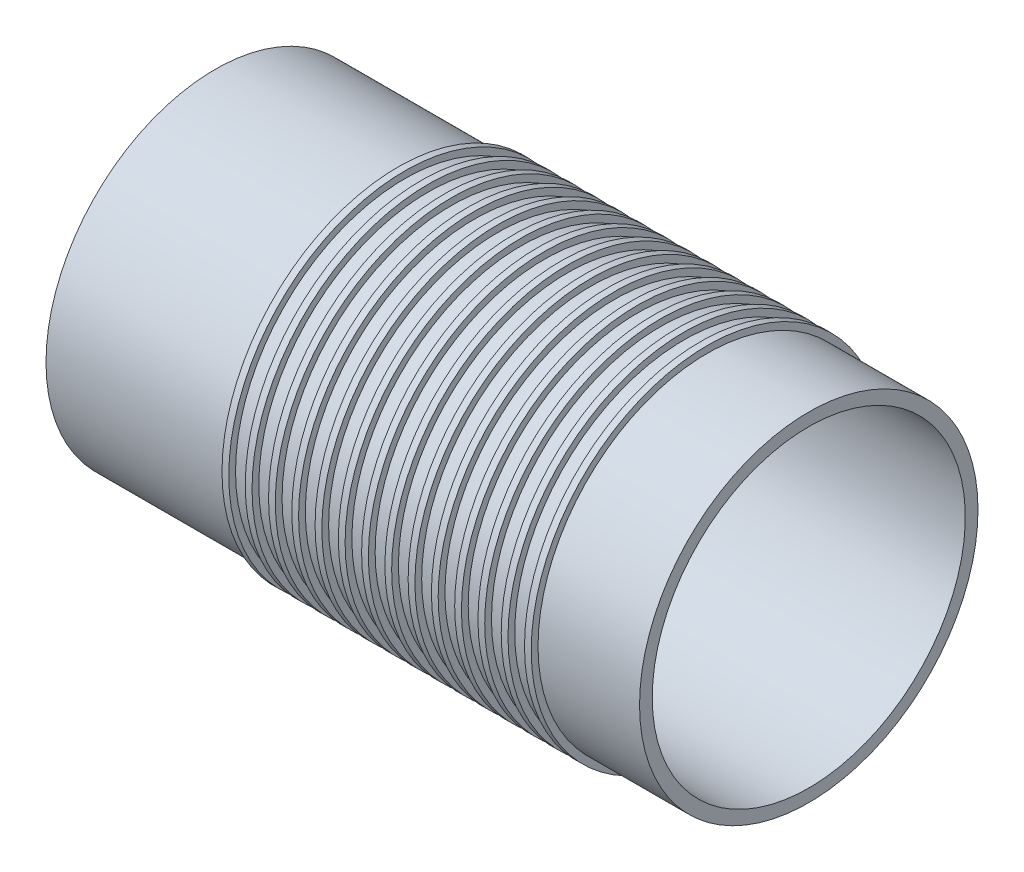
ISO-10303-21;
HEADER;
FILE_DESCRIPTION(('STEP AP214'),'2;1');
FILE_NAME('part.step','',(''),(''),'','','');
FILE_SCHEMA(('AUTOMOTIVE_DESIGN { 1 0 10303 214 1 1 1 1 }'));
ENDSEC;
DATA;
#1=APPLICATION_CONTEXT('core data for automotive mechanical design processes');
#2=APPLICATION_PROTOCOL_DEFINITION('international standard','automotive_design',2000,#1);
#3=PRODUCT_CONTEXT('',#1,'mechanical');
#4=PRODUCT('Part','Part','',(#3));
#5=PRODUCT_RELATED_PRODUCT_CATEGORY('part','',(#4));
#6=PRODUCT_DEFINITION_FORMATION('','',#4);
#7=PRODUCT_DEFINITION_CONTEXT('part definition',#1,'design');
#8=PRODUCT_DEFINITION('design','',#6,#7);
#9=PRODUCT_DEFINITION_SHAPE('','',#8);
#10=(LENGTH_UNIT() NAMED_UNIT(*) SI_UNIT(.MILLI.,.METRE.));
#11=(NAMED_UNIT(*) PLANE_ANGLE_UNIT() SI_UNIT($,.RADIAN.));
#12=(NAMED_UNIT(*) SI_UNIT($,.STERADIAN.) SOLID_ANGLE_UNIT());
#13=UNCERTAINTY_MEASURE_WITH_UNIT(LENGTH_MEASURE(1.E-05),#10,'distance_accuracy_value','');
#14=(GEOMETRIC_REPRESENTATION_CONTEXT(3) GLOBAL_UNCERTAINTY_ASSIGNED_CONTEXT((#13)) GLOBAL_UNIT_ASSIGNED_CONTEXT((#10,
#11,#12)) REPRESENTATION_CONTEXT('',''));
#15=CARTESIAN_POINT('',(0.,0.,0.));
#16=DIRECTION('',(0.,0.,1.));
#17=DIRECTION('',(1.,0.,0.));
#18=AXIS2_PLACEMENT_3D('',#15,#16,#17);
#19=CARTESIAN_POINT('',(-35.075,18.5,0.));
#20=DIRECTION('',(1.,0.,0.));
#21=DIRECTION('',(0.,0.,-1.));
#22=AXIS2_PLACEMENT_3D('',#19,#20,#21);
#23=PLANE('',#22);
#24=CARTESIAN_POINT('',(-35.075,0.,0.));
#25=DIRECTION('',(-1.,0.,0.));
#26=DIRECTION('',(0.,0.,1.));
#27=AXIS2_PLACEMENT_3D('',#24,#25,#26);
#28=CIRCLE('',#27,18.5);
#29=CARTESIAN_POINT('',(-35.075,0.,18.5));
#30=VERTEX_POINT('',#29);
#31=EDGE_CURVE('E10',#30,#30,#28,.T.);
#32=ORIENTED_EDGE('',*,*,#31,.F.);
#33=EDGE_LOOP('',(#32));
#34=FACE_BOUND('',#33,.T.);
#35=CARTESIAN_POINT('',(-35.075,0.,0.));
#36=DIRECTION('',(-1.,0.,0.));
#37=DIRECTION('',(0.,0.,1.));
#38=AXIS2_PLACEMENT_3D('',#35,#36,#37);
#39=CIRCLE('',#38,20.);
#40=CARTESIAN_POINT('',(-35.075,0.,20.));
#41=VERTEX_POINT('',#40);
#42=EDGE_CURVE('E225',#41,#41,#39,.T.);
#43=ORIENTED_EDGE('',*,*,#42,.T.);
#44=EDGE_LOOP('',(#43));
#45=FACE_BOUND('',#44,.T.);
#46=ADVANCED_FACE('F41',(#34,#45),#23,.F.);
#47=CARTESIAN_POINT('',(-100.187905083293,0.,0.));
#48=DIRECTION('',(-1.,0.,0.));
#49=DIRECTION('',(0.,0.,1.));
#50=AXIS2_PLACEMENT_3D('',#47,#48,#49);
#51=CYLINDRICAL_SURFACE('',#50,18.5);
#52=CARTESIAN_POINT('',(35.075,0.,0.));
#53=DIRECTION('',(-1.,0.,0.));
#54=DIRECTION('',(0.,0.,1.));
#55=AXIS2_PLACEMENT_3D('',#52,#53,#54);
#56=CIRCLE('',#55,18.5);
#57=CARTESIAN_POINT('',(35.075,0.,18.5));
#58=VERTEX_POINT('',#57);
#59=EDGE_CURVE('E47',#58,#58,#56,.T.);
#60=ORIENTED_EDGE('',*,*,#59,.F.);
#61=EDGE_LOOP('',(#60));
#62=FACE_BOUND('',#61,.T.);
#63=ORIENTED_EDGE('',*,*,#31,.T.);
#64=EDGE_LOOP('',(#63));
#65=FACE_BOUND('',#64,.T.);
#66=ADVANCED_FACE('F574',(#62,#65),#51,.F.);
#67=CARTESIAN_POINT('',(35.075,18.5,0.));
#68=DIRECTION('',(-1.,0.,0.));
#69=DIRECTION('',(0.,0.,1.));
#70=AXIS2_PLACEMENT_3D('',#67,#68,#69);
#71=PLANE('',#70);
#72=CARTESIAN_POINT('',(35.075,0.,0.));
#73=DIRECTION('',(-1.,0.,0.));
#74=DIRECTION('',(0.,0.,1.));
#75=AXIS2_PLACEMENT_3D('',#72,#73,#74);
#76=CIRCLE('',#75,20.);
#77=CARTESIAN_POINT('',(35.075,0.,20.));
#78=VERTEX_POINT('',#77);
#79=EDGE_CURVE('E51',#78,#78,#76,.T.);
#80=ORIENTED_EDGE('',*,*,#79,.F.);
#81=EDGE_LOOP('',(#80));
#82=FACE_BOUND('',#81,.T.);
#83=ORIENTED_EDGE('',*,*,#59,.T.);
#84=EDGE_LOOP('',(#83));
#85=FACE_BOUND('',#84,.T.);
#86=ADVANCED_FACE('F569',(#82,#85),#71,.F.);
#87=CARTESIAN_POINT('',(-100.187905083293,0.,0.));
#88=DIRECTION('',(-1.,0.,0.));
#89=DIRECTION('',(0.,0.,1.));
#90=AXIS2_PLACEMENT_3D('',#87,#88,#89);
#91=CYLINDRICAL_SURFACE('',#90,20.);
#92=CARTESIAN_POINT('',(23.075,0.,0.));
#93=DIRECTION('',(-1.,0.,0.));
#94=DIRECTION('',(0.,0.,1.));
#95=AXIS2_PLACEMENT_3D('',#92,#93,#94);
#96=CIRCLE('',#95,20.);
#97=CARTESIAN_POINT('',(23.075,0.,20.));
#98=VERTEX_POINT('',#97);
#99=EDGE_CURVE('E55',#98,#98,#96,.T.);
#100=ORIENTED_EDGE('',*,*,#99,.F.);
#101=EDGE_LOOP('',(#100));
#102=FACE_BOUND('',#101,.T.);
#103=ORIENTED_EDGE('',*,*,#79,.T.);
#104=EDGE_LOOP('',(#103));
#105=FACE_BOUND('',#104,.T.);
#106=ADVANCED_FACE('F563',(#102,#105),#91,.T.);
#107=CARTESIAN_POINT('',(23.075,20.,0.));
#108=DIRECTION('',(-1.,0.,0.));
#109=DIRECTION('',(0.,0.,1.));
#110=AXIS2_PLACEMENT_3D('',#107,#108,#109);
#111=PLANE('',#110);
#112=CARTESIAN_POINT('',(23.075,0.,0.));
#113=DIRECTION('',(-1.,0.,0.));
#114=DIRECTION('',(0.,0.,1.));
#115=AXIS2_PLACEMENT_3D('',#112,#113,#114);
#116=CIRCLE('',#115,20.8);
#117=CARTESIAN_POINT('',(23.075,0.,20.8));
#118=VERTEX_POINT('',#117);
#119=EDGE_CURVE('E60',#118,#118,#116,.T.);
#120=ORIENTED_EDGE('',*,*,#119,.F.);
#121=EDGE_LOOP('',(#120));
#122=FACE_BOUND('',#121,.T.);
#123=ORIENTED_EDGE('',*,*,#99,.T.);
#124=EDGE_LOOP('',(#123));
#125=FACE_BOUND('',#124,.T.);
#126=ADVANCED_FACE('F557',(#122,#125),#111,.F.);
#127=CARTESIAN_POINT('',(-100.187905083293,0.,0.));
#128=DIRECTION('',(-1.,0.,0.));
#129=DIRECTION('',(0.,0.,1.));
#130=AXIS2_PLACEMENT_3D('',#127,#128,#129);
#131=CYLINDRICAL_SURFACE('',#130,20.8);
#132=CARTESIAN_POINT('',(22.275,0.,0.));
#133=DIRECTION('',(-1.,0.,0.));
#134=DIRECTION('',(0.,0.,1.));
#135=AXIS2_PLACEMENT_3D('',#132,#133,#134);
#136=CIRCLE('',#135,20.8);
#137=CARTESIAN_POINT('',(22.275,0.,20.8));
#138=VERTEX_POINT('',#137);
#139=EDGE_CURVE('E63',#138,#138,#136,.T.);
#140=ORIENTED_EDGE('',*,*,#139,.F.);
#141=EDGE_LOOP('',(#140));
#142=FACE_BOUND('',#141,.T.);
#143=ORIENTED_EDGE('',*,*,#119,.T.);
#144=EDGE_LOOP('',(#143));
#145=FACE_BOUND('',#144,.T.);
#146=ADVANCED_FACE('F551',(#142,#145),#131,.T.);
#147=CARTESIAN_POINT('',(22.275,20.8,0.));
#148=DIRECTION('',(1.,0.,0.));
#149=DIRECTION('',(0.,0.,-1.));
#150=AXIS2_PLACEMENT_3D('',#147,#148,#149);
#151=PLANE('',#150);
#152=CARTESIAN_POINT('',(22.275,0.,0.));
#153=DIRECTION('',(-1.,0.,0.));
#154=DIRECTION('',(0.,0.,1.));
#155=AXIS2_PLACEMENT_3D('',#152,#153,#154);
#156=CIRCLE('',#155,20.);
#157=CARTESIAN_POINT('',(22.275,0.,20.));
#158=VERTEX_POINT('',#157);
#159=EDGE_CURVE('E66',#158,#158,#156,.T.);
#160=ORIENTED_EDGE('',*,*,#159,.F.);
#161=EDGE_LOOP('',(#160));
#162=FACE_BOUND('',#161,.T.);
#163=ORIENTED_EDGE('',*,*,#139,.T.);
#164=EDGE_LOOP('',(#163));
#165=FACE_BOUND('',#164,.T.);
#166=ADVANCED_FACE('F545',(#162,#165),#151,.F.);
#167=CARTESIAN_POINT('',(-100.187905083293,0.,0.));
#168=DIRECTION('',(-1.,0.,0.));
#169=DIRECTION('',(0.,0.,1.));
#170=AXIS2_PLACEMENT_3D('',#167,#168,#169);
#171=CYLINDRICAL_SURFACE('',#170,20.);
#172=CARTESIAN_POINT('',(20.325,0.,0.));
#173=DIRECTION('',(-1.,0.,0.));
#174=DIRECTION('',(0.,0.,1.));
#175=AXIS2_PLACEMENT_3D('',#172,#173,#174);
#176=CIRCLE('',#175,20.);
#177=CARTESIAN_POINT('',(20.325,0.,20.));
#178=VERTEX_POINT('',#177);
#179=EDGE_CURVE('E69',#178,#178,#176,.T.);
#180=ORIENTED_EDGE('',*,*,#179,.F.);
#181=EDGE_LOOP('',(#180));
#182=FACE_BOUND('',#181,.T.);
#183=ORIENTED_EDGE('',*,*,#159,.T.);
#184=EDGE_LOOP('',(#183));
#185=FACE_BOUND('',#184,.T.);
#186=ADVANCED_FACE('F539',(#182,#185),#171,.T.);
#187=CARTESIAN_POINT('',(20.325,20.,0.));
#188=DIRECTION('',(-1.,0.,0.));
#189=DIRECTION('',(0.,0.,1.));
#190=AXIS2_PLACEMENT_3D('',#187,#188,#189);
#191=PLANE('',#190);
#192=CARTESIAN_POINT('',(20.325,0.,0.));
#193=DIRECTION('',(-1.,0.,0.));
#194=DIRECTION('',(0.,0.,1.));
#195=AXIS2_PLACEMENT_3D('',#192,#193,#194);
#196=CIRCLE('',#195,20.8);
#197=CARTESIAN_POINT('',(20.325,0.,20.8));
#198=VERTEX_POINT('',#197);
#199=EDGE_CURVE('E72',#198,#198,#196,.T.);
#200=ORIENTED_EDGE('',*,*,#199,.F.);
#201=EDGE_LOOP('',(#200));
#202=FACE_BOUND('',#201,.T.);
#203=ORIENTED_EDGE('',*,*,#179,.T.);
#204=EDGE_LOOP('',(#203));
#205=FACE_BOUND('',#204,.T.);
#206=ADVANCED_FACE('F533',(#202,#205),#191,.F.);
#207=CARTESIAN_POINT('',(-100.187905083293,0.,0.));
#208=DIRECTION('',(-1.,0.,0.));
#209=DIRECTION('',(0.,0.,1.));
#210=AXIS2_PLACEMENT_3D('',#207,#208,#209);
#211=CYLINDRICAL_SURFACE('',#210,20.8);
#212=CARTESIAN_POINT('',(19.525,0.,0.));
#213=DIRECTION('',(-1.,0.,0.));
#214=DIRECTION('',(0.,0.,1.));
#215=AXIS2_PLACEMENT_3D('',#212,#213,#214);
#216=CIRCLE('',#215,20.8);
#217=CARTESIAN_POINT('',(19.525,0.,20.8));
#218=VERTEX_POINT('',#217);
#219=EDGE_CURVE('E75',#218,#218,#216,.T.);
#220=ORIENTED_EDGE('',*,*,#219,.F.);
#221=EDGE_LOOP('',(#220));
#222=FACE_BOUND('',#221,.T.);
#223=ORIENTED_EDGE('',*,*,#199,.T.);
#224=EDGE_LOOP('',(#223));
#225=FACE_BOUND('',#224,.T.);
#226=ADVANCED_FACE('F527',(#222,#225),#211,.T.);
#227=CARTESIAN_POINT('',(19.525,20.8,0.));
#228=DIRECTION('',(1.,0.,0.));
#229=DIRECTION('',(0.,0.,-1.));
#230=AXIS2_PLACEMENT_3D('',#227,#228,#229);
#231=PLANE('',#230);
#232=CARTESIAN_POINT('',(19.525,0.,0.));
#233=DIRECTION('',(-1.,0.,0.));
#234=DIRECTION('',(0.,0.,1.));
#235=AXIS2_PLACEMENT_3D('',#232,#233,#234);
#236=CIRCLE('',#235,20.);
#237=CARTESIAN_POINT('',(19.525,0.,20.));
#238=VERTEX_POINT('',#237);
#239=EDGE_CURVE('E78',#238,#238,#236,.T.);
#240=ORIENTED_EDGE('',*,*,#239,.F.);
#241=EDGE_LOOP('',(#240));
#242=FACE_BOUND('',#241,.T.);
#243=ORIENTED_EDGE('',*,*,#219,.T.);
#244=EDGE_LOOP('',(#243));
#245=FACE_BOUND('',#244,.T.);
#246=ADVANCED_FACE('F521',(#242,#245),#231,.F.);
#247=CARTESIAN_POINT('',(-100.187905083293,0.,0.));
#248=DIRECTION('',(-1.,0.,0.));
#249=DIRECTION('',(0.,0.,1.));
#250=AXIS2_PLACEMENT_3D('',#247,#248,#249);
#251=CYLINDRICAL_SURFACE('',#250,20.);
#252=CARTESIAN_POINT('',(17.575,0.,0.));
#253=DIRECTION('',(-1.,0.,0.));
#254=DIRECTION('',(0.,0.,1.));
#255=AXIS2_PLACEMENT_3D('',#252,#253,#254);
#256=CIRCLE('',#255,20.);
#257=CARTESIAN_POINT('',(17.575,0.,20.));
#258=VERTEX_POINT('',#257);
#259=EDGE_CURVE('E81',#258,#258,#256,.T.);
#260=ORIENTED_EDGE('',*,*,#259,.F.);
#261=EDGE_LOOP('',(#260));
#262=FACE_BOUND('',#261,.T.);
#263=ORIENTED_EDGE('',*,*,#239,.T.);
#264=EDGE_LOOP('',(#263));
#265=FACE_BOUND('',#264,.T.);
#266=ADVANCED_FACE('F515',(#262,#265),#251,.T.);
#267=CARTESIAN_POINT('',(17.575,20.,0.));
#268=DIRECTION('',(-1.,0.,0.));
#269=DIRECTION('',(0.,0.,1.));
#270=AXIS2_PLACEMENT_3D('',#267,#268,#269);
#271=PLANE('',#270);
#272=CARTESIAN_POINT('',(17.575,0.,0.));
#273=DIRECTION('',(-1.,0.,0.));
#274=DIRECTION('',(0.,0.,1.));
#275=AXIS2_PLACEMENT_3D('',#272,#273,#274);
#276=CIRCLE('',#275,20.8);
#277=CARTESIAN_POINT('',(17.575,0.,20.8));
#278=VERTEX_POINT('',#277);
#279=EDGE_CURVE('E84',#278,#278,#276,.T.);
#280=ORIENTED_EDGE('',*,*,#279,.F.);
#281=EDGE_LOOP('',(#280));
#282=FACE_BOUND('',#281,.T.);
#283=ORIENTED_EDGE('',*,*,#259,.T.);
#284=EDGE_LOOP('',(#283));
#285=FACE_BOUND('',#284,.T.);
#286=ADVANCED_FACE('F509',(#282,#285),#271,.F.);
#287=CARTESIAN_POINT('',(-100.187905083293,0.,0.));
#288=DIRECTION('',(-1.,0.,0.));
#289=DIRECTION('',(0.,0.,1.));
#290=AXIS2_PLACEMENT_3D('',#287,#288,#289);
#291=CYLINDRICAL_SURFACE('',#290,20.8);
#292=CARTESIAN_POINT('',(16.775,0.,0.));
#293=DIRECTION('',(-1.,0.,0.));
#294=DIRECTION('',(0.,0.,1.));
#295=AXIS2_PLACEMENT_3D('',#292,#293,#294);
#296=CIRCLE('',#295,20.8);
#297=CARTESIAN_POINT('',(16.775,0.,20.8));
#298=VERTEX_POINT('',#297);
#299=EDGE_CURVE('E87',#298,#298,#296,.T.);
#300=ORIENTED_EDGE('',*,*,#299,.F.);
#301=EDGE_LOOP('',(#300));
#302=FACE_BOUND('',#301,.T.);
#303=ORIENTED_EDGE('',*,*,#279,.T.);
#304=EDGE_LOOP('',(#303));
#305=FACE_BOUND('',#304,.T.);
#306=ADVANCED_FACE('F503',(#302,#305),#291,.T.);
#307=CARTESIAN_POINT('',(16.775,20.8,0.));
#308=DIRECTION('',(1.,0.,0.));
#309=DIRECTION('',(0.,0.,-1.));
#310=AXIS2_PLACEMENT_3D('',#307,#308,#309);
#311=PLANE('',#310);
#312=CARTESIAN_POINT('',(16.775,0.,0.));
#313=DIRECTION('',(-1.,0.,0.));
#314=DIRECTION('',(0.,0.,1.));
#315=AXIS2_PLACEMENT_3D('',#312,#313,#314);
#316=CIRCLE('',#315,20.);
#317=CARTESIAN_POINT('',(16.775,0.,20.));
#318=VERTEX_POINT('',#317);
#319=EDGE_CURVE('E90',#318,#318,#316,.T.);
#320=ORIENTED_EDGE('',*,*,#319,.F.);
#321=EDGE_LOOP('',(#320));
#322=FACE_BOUND('',#321,.T.);
#323=ORIENTED_EDGE('',*,*,#299,.T.);
#324=EDGE_LOOP('',(#323));
#325=FACE_BOUND('',#324,.T.);
#326=ADVANCED_FACE('F497',(#322,#325),#311,.F.);
#327=CARTESIAN_POINT('',(-100.187905083293,0.,0.));
#328=DIRECTION('',(-1.,0.,0.));
#329=DIRECTION('',(0.,0.,1.));
#330=AXIS2_PLACEMENT_3D('',#327,#328,#329);
#331=CYLINDRICAL_SURFACE('',#330,20.);
#332=CARTESIAN_POINT('',(14.825,0.,0.));
#333=DIRECTION('',(-1.,0.,0.));
#334=DIRECTION('',(0.,0.,1.));
#335=AXIS2_PLACEMENT_3D('',#332,#333,#334);
#336=CIRCLE('',#335,20.);
#337=CARTESIAN_POINT('',(14.825,0.,20.));
#338=VERTEX_POINT('',#337);
#339=EDGE_CURVE('E93',#338,#338,#336,.T.);
#340=ORIENTED_EDGE('',*,*,#339,.F.);
#341=EDGE_LOOP('',(#340));
#342=FACE_BOUND('',#341,.T.);
#343=ORIENTED_EDGE('',*,*,#319,.T.);
#344=EDGE_LOOP('',(#343));
#345=FACE_BOUND('',#344,.T.);
#346=ADVANCED_FACE('F491',(#342,#345),#331,.T.);
#347=CARTESIAN_POINT('',(14.825,20.,0.));
#348=DIRECTION('',(-1.,0.,0.));
#349=DIRECTION('',(0.,0.,1.));
#350=AXIS2_PLACEMENT_3D('',#347,#348,#349);
#351=PLANE('',#350);
#352=CARTESIAN_POINT('',(14.825,0.,0.));
#353=DIRECTION('',(-1.,0.,0.));
#354=DIRECTION('',(0.,0.,1.));
#355=AXIS2_PLACEMENT_3D('',#352,#353,#354);
#356=CIRCLE('',#355,20.8);
#357=CARTESIAN_POINT('',(14.825,0.,20.8));
#358=VERTEX_POINT('',#357);
#359=EDGE_CURVE('E96',#358,#358,#356,.T.);
#360=ORIENTED_EDGE('',*,*,#359,.F.);
#361=EDGE_LOOP('',(#360));
#362=FACE_BOUND('',#361,.T.);
#363=ORIENTED_EDGE('',*,*,#339,.T.);
#364=EDGE_LOOP('',(#363));
#365=FACE_BOUND('',#364,.T.);
#366=ADVANCED_FACE('F485',(#362,#365),#351,.F.);
#367=CARTESIAN_POINT('',(-100.187905083293,0.,0.));
#368=DIRECTION('',(-1.,0.,0.));
#369=DIRECTION('',(0.,0.,1.));
#370=AXIS2_PLACEMENT_3D('',#367,#368,#369);
#371=CYLINDRICAL_SURFACE('',#370,20.8);
#372=CARTESIAN_POINT('',(14.025,0.,0.));
#373=DIRECTION('',(-1.,0.,0.));
#374=DIRECTION('',(0.,0.,1.));
#375=AXIS2_PLACEMENT_3D('',#372,#373,#374);
#376=CIRCLE('',#375,20.8);
#377=CARTESIAN_POINT('',(14.025,0.,20.8));
#378=VERTEX_POINT('',#377);
#379=EDGE_CURVE('E99',#378,#378,#376,.T.);
#380=ORIENTED_EDGE('',*,*,#379,.F.);
#381=EDGE_LOOP('',(#380));
#382=FACE_BOUND('',#381,.T.);
#383=ORIENTED_EDGE('',*,*,#359,.T.);
#384=EDGE_LOOP('',(#383));
#385=FACE_BOUND('',#384,.T.);
#386=ADVANCED_FACE('F479',(#382,#385),#371,.T.);
#387=CARTESIAN_POINT('',(14.025,20.8,0.));
#388=DIRECTION('',(1.,0.,0.));
#389=DIRECTION('',(0.,0.,-1.));
#390=AXIS2_PLACEMENT_3D('',#387,#388,#389);
#391=PLANE('',#390);
#392=CARTESIAN_POINT('',(14.025,0.,0.));
#393=DIRECTION('',(-1.,0.,0.));
#394=DIRECTION('',(0.,0.,1.));
#395=AXIS2_PLACEMENT_3D('',#392,#393,#394);
#396=CIRCLE('',#395,20.);
#397=CARTESIAN_POINT('',(14.025,0.,20.));
#398=VERTEX_POINT('',#397);
#399=EDGE_CURVE('E102',#398,#398,#396,.T.);
#400=ORIENTED_EDGE('',*,*,#399,.F.);
#401=EDGE_LOOP('',(#400));
#402=FACE_BOUND('',#401,.T.);
#403=ORIENTED_EDGE('',*,*,#379,.T.);
#404=EDGE_LOOP('',(#403));
#405=FACE_BOUND('',#404,.T.);
#406=ADVANCED_FACE('F473',(#402,#405),#391,.F.);
#407=CARTESIAN_POINT('',(-100.187905083293,0.,0.));
#408=DIRECTION('',(-1.,0.,0.));
#409=DIRECTION('',(0.,0.,1.));
#410=AXIS2_PLACEMENT_3D('',#407,#408,#409);
#411=CYLINDRICAL_SURFACE('',#410,20.);
#412=CARTESIAN_POINT('',(12.075,0.,0.));
#413=DIRECTION('',(-1.,0.,0.));
#414=DIRECTION('',(0.,0.,1.));
#415=AXIS2_PLACEMENT_3D('',#412,#413,#414);
#416=CIRCLE('',#415,20.);
#417=CARTESIAN_POINT('',(12.075,0.,20.));
#418=VERTEX_POINT('',#417);
#419=EDGE_CURVE('E105',#418,#418,#416,.T.);
#420=ORIENTED_EDGE('',*,*,#419,.F.);
#421=EDGE_LOOP('',(#420));
#422=FACE_BOUND('',#421,.T.);
#423=ORIENTED_EDGE('',*,*,#399,.T.);
#424=EDGE_LOOP('',(#423));
#425=FACE_BOUND('',#424,.T.);
#426=ADVANCED_FACE('F467',(#422,#425),#411,.T.);
#427=CARTESIAN_POINT('',(12.075,20.,0.));
#428=DIRECTION('',(-1.,0.,0.));
#429=DIRECTION('',(0.,0.,1.));
#430=AXIS2_PLACEMENT_3D('',#427,#428,#429);
#431=PLANE('',#430);
#432=CARTESIAN_POINT('',(12.075,0.,0.));
#433=DIRECTION('',(-1.,0.,0.));
#434=DIRECTION('',(0.,0.,1.));
#435=AXIS2_PLACEMENT_3D('',#432,#433,#434);
#436=CIRCLE('',#435,20.8);
#437=CARTESIAN_POINT('',(12.075,0.,20.8));
#438=VERTEX_POINT('',#437);
#439=EDGE_CURVE('E108',#438,#438,#436,.T.);
#440=ORIENTED_EDGE('',*,*,#439,.F.);
#441=EDGE_LOOP('',(#440));
#442=FACE_BOUND('',#441,.T.);
#443=ORIENTED_EDGE('',*,*,#419,.T.);
#444=EDGE_LOOP('',(#443));
#445=FACE_BOUND('',#444,.T.);
#446=ADVANCED_FACE('F461',(#442,#445),#431,.F.);
#447=CARTESIAN_POINT('',(-100.187905083293,0.,0.));
#448=DIRECTION('',(-1.,0.,0.));
#449=DIRECTION('',(0.,0.,1.));
#450=AXIS2_PLACEMENT_3D('',#447,#448,#449);
#451=CYLINDRICAL_SURFACE('',#450,20.8);
#452=CARTESIAN_POINT('',(11.275,0.,0.));
#453=DIRECTION('',(-1.,0.,0.));
#454=DIRECTION('',(0.,0.,1.));
#455=AXIS2_PLACEMENT_3D('',#452,#453,#454);
#456=CIRCLE('',#455,20.8);
#457=CARTESIAN_POINT('',(11.275,0.,20.8));
#458=VERTEX_POINT('',#457);
#459=EDGE_CURVE('E111',#458,#458,#456,.T.);
#460=ORIENTED_EDGE('',*,*,#459,.F.);
#461=EDGE_LOOP('',(#460));
#462=FACE_BOUND('',#461,.T.);
#463=ORIENTED_EDGE('',*,*,#439,.T.);
#464=EDGE_LOOP('',(#463));
#465=FACE_BOUND('',#464,.T.);
#466=ADVANCED_FACE('F455',(#462,#465),#451,.T.);
#467=CARTESIAN_POINT('',(11.275,20.8,0.));
#468=DIRECTION('',(1.,0.,0.));
#469=DIRECTION('',(0.,0.,-1.));
#470=AXIS2_PLACEMENT_3D('',#467,#468,#469);
#471=PLANE('',#470);
#472=CARTESIAN_POINT('',(11.275,0.,0.));
#473=DIRECTION('',(-1.,0.,0.));
#474=DIRECTION('',(0.,0.,1.));
#475=AXIS2_PLACEMENT_3D('',#472,#473,#474);
#476=CIRCLE('',#475,20.);
#477=CARTESIAN_POINT('',(11.275,0.,20.));
#478=VERTEX_POINT('',#477);
#479=EDGE_CURVE('E114',#478,#478,#476,.T.);
#480=ORIENTED_EDGE('',*,*,#479,.F.);
#481=EDGE_LOOP('',(#480));
#482=FACE_BOUND('',#481,.T.);
#483=ORIENTED_EDGE('',*,*,#459,.T.);
#484=EDGE_LOOP('',(#483));
#485=FACE_BOUND('',#484,.T.);
#486=ADVANCED_FACE('F449',(#482,#485),#471,.F.);
#487=CARTESIAN_POINT('',(-100.187905083293,0.,0.));
#488=DIRECTION('',(-1.,0.,0.));
#489=DIRECTION('',(0.,0.,1.));
#490=AXIS2_PLACEMENT_3D('',#487,#488,#489);
#491=CYLINDRICAL_SURFACE('',#490,20.);
#492=CARTESIAN_POINT('',(9.325,0.,0.));
#493=DIRECTION('',(-1.,0.,0.));
#494=DIRECTION('',(0.,0.,1.));
#495=AXIS2_PLACEMENT_3D('',#492,#493,#494);
#496=CIRCLE('',#495,20.);
#497=CARTESIAN_POINT('',(9.325,0.,20.));
#498=VERTEX_POINT('',#497);
#499=EDGE_CURVE('E117',#498,#498,#496,.T.);
#500=ORIENTED_EDGE('',*,*,#499,.F.);
#501=EDGE_LOOP('',(#500));
#502=FACE_BOUND('',#501,.T.);
#503=ORIENTED_EDGE('',*,*,#479,.T.);
#504=EDGE_LOOP('',(#503));
#505=FACE_BOUND('',#504,.T.);
#506=ADVANCED_FACE('F443',(#502,#505),#491,.T.);
#507=CARTESIAN_POINT('',(9.32500000000001,20.,0.));
#508=DIRECTION('',(-1.,0.,0.));
#509=DIRECTION('',(0.,0.,1.));
#510=AXIS2_PLACEMENT_3D('',#507,#508,#509);
#511=PLANE('',#510);
#512=CARTESIAN_POINT('',(9.325,0.,0.));
#513=DIRECTION('',(-1.,0.,0.));
#514=DIRECTION('',(0.,0.,1.));
#515=AXIS2_PLACEMENT_3D('',#512,#513,#514);
#516=CIRCLE('',#515,20.8);
#517=CARTESIAN_POINT('',(9.325,0.,20.8));
#518=VERTEX_POINT('',#517);
#519=EDGE_CURVE('E120',#518,#518,#516,.T.);
#520=ORIENTED_EDGE('',*,*,#519,.F.);
#521=EDGE_LOOP('',(#520));
#522=FACE_BOUND('',#521,.T.);
#523=ORIENTED_EDGE('',*,*,#499,.T.);
#524=EDGE_LOOP('',(#523));
#525=FACE_BOUND('',#524,.T.);
#526=ADVANCED_FACE('F437',(#522,#525),#511,.F.);
#527=CARTESIAN_POINT('',(-100.187905083293,0.,0.));
#528=DIRECTION('',(-1.,0.,0.));
#529=DIRECTION('',(0.,0.,1.));
#530=AXIS2_PLACEMENT_3D('',#527,#528,#529);
#531=CYLINDRICAL_SURFACE('',#530,20.8);
#532=CARTESIAN_POINT('',(8.52500000000001,0.,0.));
#533=DIRECTION('',(-1.,0.,0.));
#534=DIRECTION('',(0.,0.,1.));
#535=AXIS2_PLACEMENT_3D('',#532,#533,#534);
#536=CIRCLE('',#535,20.8);
#537=CARTESIAN_POINT('',(8.52500000000001,0.,20.8));
#538=VERTEX_POINT('',#537);
#539=EDGE_CURVE('E123',#538,#538,#536,.T.);
#540=ORIENTED_EDGE('',*,*,#539,.F.);
#541=EDGE_LOOP('',(#540));
#542=FACE_BOUND('',#541,.T.);
#543=ORIENTED_EDGE('',*,*,#519,.T.);
#544=EDGE_LOOP('',(#543));
#545=FACE_BOUND('',#544,.T.);
#546=ADVANCED_FACE('F431',(#542,#545),#531,.T.);
#547=CARTESIAN_POINT('',(8.52500000000001,20.8,0.));
#548=DIRECTION('',(1.,0.,0.));
#549=DIRECTION('',(0.,0.,-1.));
#550=AXIS2_PLACEMENT_3D('',#547,#548,#549);
#551=PLANE('',#550);
#552=CARTESIAN_POINT('',(8.52500000000001,0.,0.));
#553=DIRECTION('',(-1.,0.,0.));
#554=DIRECTION('',(0.,0.,1.));
#555=AXIS2_PLACEMENT_3D('',#552,#553,#554);
#556=CIRCLE('',#555,20.);
#557=CARTESIAN_POINT('',(8.52500000000001,0.,20.));
#558=VERTEX_POINT('',#557);
#559=EDGE_CURVE('E126',#558,#558,#556,.T.);
#560=ORIENTED_EDGE('',*,*,#559,.F.);
#561=EDGE_LOOP('',(#560));
#562=FACE_BOUND('',#561,.T.);
#563=ORIENTED_EDGE('',*,*,#539,.T.);
#564=EDGE_LOOP('',(#563));
#565=FACE_BOUND('',#564,.T.);
#566=ADVANCED_FACE('F425',(#562,#565),#551,.F.);
#567=CARTESIAN_POINT('',(-100.187905083293,0.,0.));
#568=DIRECTION('',(-1.,0.,0.));
#569=DIRECTION('',(0.,0.,1.));
#570=AXIS2_PLACEMENT_3D('',#567,#568,#569);
#571=CYLINDRICAL_SURFACE('',#570,20.);
#572=CARTESIAN_POINT('',(6.57500000000001,0.,0.));
#573=DIRECTION('',(-1.,0.,0.));
#574=DIRECTION('',(0.,0.,1.));
#575=AXIS2_PLACEMENT_3D('',#572,#573,#574);
#576=CIRCLE('',#575,20.);
#577=CARTESIAN_POINT('',(6.57500000000001,0.,20.));
#578=VERTEX_POINT('',#577);
#579=EDGE_CURVE('E129',#578,#578,#576,.T.);
#580=ORIENTED_EDGE('',*,*,#579,.F.);
#581=EDGE_LOOP('',(#580));
#582=FACE_BOUND('',#581,.T.);
#583=ORIENTED_EDGE('',*,*,#559,.T.);
#584=EDGE_LOOP('',(#583));
#585=FACE_BOUND('',#584,.T.);
#586=ADVANCED_FACE('F419',(#582,#585),#571,.T.);
#587=CARTESIAN_POINT('',(6.57500000000001,20.,0.));
#588=DIRECTION('',(-1.,0.,0.));
#589=DIRECTION('',(0.,0.,1.));
#590=AXIS2_PLACEMENT_3D('',#587,#588,#589);
#591=PLANE('',#590);
#592=CARTESIAN_POINT('',(6.57500000000001,0.,0.));
#593=DIRECTION('',(-1.,0.,0.));
#594=DIRECTION('',(0.,0.,1.));
#595=AXIS2_PLACEMENT_3D('',#592,#593,#594);
#596=CIRCLE('',#595,20.8);
#597=CARTESIAN_POINT('',(6.57500000000001,0.,20.8));
#598=VERTEX_POINT('',#597);
#599=EDGE_CURVE('E132',#598,#598,#596,.T.);
#600=ORIENTED_EDGE('',*,*,#599,.F.);
#601=EDGE_LOOP('',(#600));
#602=FACE_BOUND('',#601,.T.);
#603=ORIENTED_EDGE('',*,*,#579,.T.);
#604=EDGE_LOOP('',(#603));
#605=FACE_BOUND('',#604,.T.);
#606=ADVANCED_FACE('F413',(#602,#605),#591,.F.);
#607=CARTESIAN_POINT('',(-100.187905083293,0.,0.));
#608=DIRECTION('',(-1.,0.,0.));
#609=DIRECTION('',(0.,0.,1.));
#610=AXIS2_PLACEMENT_3D('',#607,#608,#609);
#611=CYLINDRICAL_SURFACE('',#610,20.8);
#612=CARTESIAN_POINT('',(5.775,0.,0.));
#613=DIRECTION('',(-1.,0.,0.));
#614=DIRECTION('',(0.,0.,1.));
#615=AXIS2_PLACEMENT_3D('',#612,#613,#614);
#616=CIRCLE('',#615,20.8);
#617=CARTESIAN_POINT('',(5.775,0.,20.8));
#618=VERTEX_POINT('',#617);
#619=EDGE_CURVE('E135',#618,#618,#616,.T.);
#620=ORIENTED_EDGE('',*,*,#619,.F.);
#621=EDGE_LOOP('',(#620));
#622=FACE_BOUND('',#621,.T.);
#623=ORIENTED_EDGE('',*,*,#599,.T.);
#624=EDGE_LOOP('',(#623));
#625=FACE_BOUND('',#624,.T.);
#626=ADVANCED_FACE('F407',(#622,#625),#611,.T.);
#627=CARTESIAN_POINT('',(5.77500000000001,20.8,0.));
#628=DIRECTION('',(1.,0.,0.));
#629=DIRECTION('',(0.,0.,-1.));
#630=AXIS2_PLACEMENT_3D('',#627,#628,#629);
#631=PLANE('',#630);
#632=CARTESIAN_POINT('',(5.775,0.,0.));
#633=DIRECTION('',(-1.,0.,0.));
#634=DIRECTION('',(0.,0.,1.));
#635=AXIS2_PLACEMENT_3D('',#632,#633,#634);
#636=CIRCLE('',#635,20.);
#637=CARTESIAN_POINT('',(5.775,0.,20.));
#638=VERTEX_POINT('',#637);
#639=EDGE_CURVE('E138',#638,#638,#636,.T.);
#640=ORIENTED_EDGE('',*,*,#639,.F.);
#641=EDGE_LOOP('',(#640));
#642=FACE_BOUND('',#641,.T.);
#643=ORIENTED_EDGE('',*,*,#619,.T.);
#644=EDGE_LOOP('',(#643));
#645=FACE_BOUND('',#644,.T.);
#646=ADVANCED_FACE('F401',(#642,#645),#631,.F.);
#647=CARTESIAN_POINT('',(-100.187905083293,0.,0.));
#648=DIRECTION('',(-1.,0.,0.));
#649=DIRECTION('',(0.,0.,1.));
#650=AXIS2_PLACEMENT_3D('',#647,#648,#649);
#651=CYLINDRICAL_SURFACE('',#650,20.);
#652=CARTESIAN_POINT('',(3.82500000000001,0.,0.));
#653=DIRECTION('',(-1.,0.,0.));
#654=DIRECTION('',(0.,0.,1.));
#655=AXIS2_PLACEMENT_3D('',#652,#653,#654);
#656=CIRCLE('',#655,20.);
#657=CARTESIAN_POINT('',(3.82500000000001,0.,20.));
#658=VERTEX_POINT('',#657);
#659=EDGE_CURVE('E141',#658,#658,#656,.T.);
#660=ORIENTED_EDGE('',*,*,#659,.F.);
#661=EDGE_LOOP('',(#660));
#662=FACE_BOUND('',#661,.T.);
#663=ORIENTED_EDGE('',*,*,#639,.T.);
#664=EDGE_LOOP('',(#663));
#665=FACE_BOUND('',#664,.T.);
#666=ADVANCED_FACE('F395',(#662,#665),#651,.T.);
#667=CARTESIAN_POINT('',(3.82500000000001,20.,0.));
#668=DIRECTION('',(-1.,0.,0.));
#669=DIRECTION('',(0.,0.,1.));
#670=AXIS2_PLACEMENT_3D('',#667,#668,#669);
#671=PLANE('',#670);
#672=CARTESIAN_POINT('',(3.82500000000001,0.,0.));
#673=DIRECTION('',(-1.,0.,0.));
#674=DIRECTION('',(0.,0.,1.));
#675=AXIS2_PLACEMENT_3D('',#672,#673,#674);
#676=CIRCLE('',#675,20.8);
#677=CARTESIAN_POINT('',(3.82500000000001,0.,20.8));
#678=VERTEX_POINT('',#677);
#679=EDGE_CURVE('E144',#678,#678,#676,.T.);
#680=ORIENTED_EDGE('',*,*,#679,.F.);
#681=EDGE_LOOP('',(#680));
#682=FACE_BOUND('',#681,.T.);
#683=ORIENTED_EDGE('',*,*,#659,.T.);
#684=EDGE_LOOP('',(#683));
#685=FACE_BOUND('',#684,.T.);
#686=ADVANCED_FACE('F389',(#682,#685),#671,.F.);
#687=CARTESIAN_POINT('',(-100.187905083293,0.,0.));
#688=DIRECTION('',(-1.,0.,0.));
#689=DIRECTION('',(0.,0.,1.));
#690=AXIS2_PLACEMENT_3D('',#687,#688,#689);
#691=CYLINDRICAL_SURFACE('',#690,20.8);
#692=CARTESIAN_POINT('',(3.02500000000001,0.,0.));
#693=DIRECTION('',(-1.,0.,0.));
#694=DIRECTION('',(0.,0.,1.));
#695=AXIS2_PLACEMENT_3D('',#692,#693,#694);
#696=CIRCLE('',#695,20.8);
#697=CARTESIAN_POINT('',(3.02500000000001,0.,20.8));
#698=VERTEX_POINT('',#697);
#699=EDGE_CURVE('E147',#698,#698,#696,.T.);
#700=ORIENTED_EDGE('',*,*,#699,.F.);
#701=EDGE_LOOP('',(#700));
#702=FACE_BOUND('',#701,.T.);
#703=ORIENTED_EDGE('',*,*,#679,.T.);
#704=EDGE_LOOP('',(#703));
#705=FACE_BOUND('',#704,.T.);
#706=ADVANCED_FACE('F383',(#702,#705),#691,.T.);
#707=CARTESIAN_POINT('',(3.02500000000001,20.8,0.));
#708=DIRECTION('',(1.,0.,0.));
#709=DIRECTION('',(0.,0.,-1.));
#710=AXIS2_PLACEMENT_3D('',#707,#708,#709);
#711=PLANE('',#710);
#712=CARTESIAN_POINT('',(3.02500000000001,0.,0.));
#713=DIRECTION('',(-1.,0.,0.));
#714=DIRECTION('',(0.,0.,1.));
#715=AXIS2_PLACEMENT_3D('',#712,#713,#714);
#716=CIRCLE('',#715,20.);
#717=CARTESIAN_POINT('',(3.02500000000001,0.,20.));
#718=VERTEX_POINT('',#717);
#719=EDGE_CURVE('E150',#718,#718,#716,.T.);
#720=ORIENTED_EDGE('',*,*,#719,.F.);
#721=EDGE_LOOP('',(#720));
#722=FACE_BOUND('',#721,.T.);
#723=ORIENTED_EDGE('',*,*,#699,.T.);
#724=EDGE_LOOP('',(#723));
#725=FACE_BOUND('',#724,.T.);
#726=ADVANCED_FACE('F377',(#722,#725),#711,.F.);
#727=CARTESIAN_POINT('',(-100.187905083293,0.,0.));
#728=DIRECTION('',(-1.,0.,0.));
#729=DIRECTION('',(0.,0.,1.));
#730=AXIS2_PLACEMENT_3D('',#727,#728,#729);
#731=CYLINDRICAL_SURFACE('',#730,20.);
#732=CARTESIAN_POINT('',(1.07500000000001,0.,0.));
#733=DIRECTION('',(-1.,0.,0.));
#734=DIRECTION('',(0.,0.,1.));
#735=AXIS2_PLACEMENT_3D('',#732,#733,#734);
#736=CIRCLE('',#735,20.);
#737=CARTESIAN_POINT('',(1.07500000000001,0.,20.));
#738=VERTEX_POINT('',#737);
#739=EDGE_CURVE('E153',#738,#738,#736,.T.);
#740=ORIENTED_EDGE('',*,*,#739,.F.);
#741=EDGE_LOOP('',(#740));
#742=FACE_BOUND('',#741,.T.);
#743=ORIENTED_EDGE('',*,*,#719,.T.);
#744=EDGE_LOOP('',(#743));
#745=FACE_BOUND('',#744,.T.);
#746=ADVANCED_FACE('F371',(#742,#745),#731,.T.);
#747=CARTESIAN_POINT('',(1.07500000000001,20.,0.));
#748=DIRECTION('',(-1.,0.,0.));
#749=DIRECTION('',(0.,0.,1.));
#750=AXIS2_PLACEMENT_3D('',#747,#748,#749);
#751=PLANE('',#750);
#752=CARTESIAN_POINT('',(1.07500000000001,0.,0.));
#753=DIRECTION('',(-1.,0.,0.));
#754=DIRECTION('',(0.,0.,1.));
#755=AXIS2_PLACEMENT_3D('',#752,#753,#754);
#756=CIRCLE('',#755,20.8);
#757=CARTESIAN_POINT('',(1.07500000000001,0.,20.8));
#758=VERTEX_POINT('',#757);
#759=EDGE_CURVE('E156',#758,#758,#756,.T.);
#760=ORIENTED_EDGE('',*,*,#759,.F.);
#761=EDGE_LOOP('',(#760));
#762=FACE_BOUND('',#761,.T.);
#763=ORIENTED_EDGE('',*,*,#739,.T.);
#764=EDGE_LOOP('',(#763));
#765=FACE_BOUND('',#764,.T.);
#766=ADVANCED_FACE('F365',(#762,#765),#751,.F.);
#767=CARTESIAN_POINT('',(-100.187905083293,0.,0.));
#768=DIRECTION('',(-1.,0.,0.));
#769=DIRECTION('',(0.,0.,1.));
#770=AXIS2_PLACEMENT_3D('',#767,#768,#769);
#771=CYLINDRICAL_SURFACE('',#770,20.8);
#772=CARTESIAN_POINT('',(0.275000000000011,0.,0.));
#773=DIRECTION('',(-1.,0.,0.));
#774=DIRECTION('',(0.,0.,1.));
#775=AXIS2_PLACEMENT_3D('',#772,#773,#774);
#776=CIRCLE('',#775,20.8);
#777=CARTESIAN_POINT('',(0.275000000000011,0.,20.8));
#778=VERTEX_POINT('',#777);
#779=EDGE_CURVE('E159',#778,#778,#776,.T.);
#780=ORIENTED_EDGE('',*,*,#779,.F.);
#781=EDGE_LOOP('',(#780));
#782=FACE_BOUND('',#781,.T.);
#783=ORIENTED_EDGE('',*,*,#759,.T.);
#784=EDGE_LOOP('',(#783));
#785=FACE_BOUND('',#784,.T.);
#786=ADVANCED_FACE('F359',(#782,#785),#771,.T.);
#787=CARTESIAN_POINT('',(0.275000000000011,20.8,0.));
#788=DIRECTION('',(1.,0.,0.));
#789=DIRECTION('',(0.,0.,-1.));
#790=AXIS2_PLACEMENT_3D('',#787,#788,#789);
#791=PLANE('',#790);
#792=CARTESIAN_POINT('',(0.275000000000011,0.,0.));
#793=DIRECTION('',(-1.,0.,0.));
#794=DIRECTION('',(0.,0.,1.));
#795=AXIS2_PLACEMENT_3D('',#792,#793,#794);
#796=CIRCLE('',#795,20.);
#797=CARTESIAN_POINT('',(0.275000000000011,0.,20.));
#798=VERTEX_POINT('',#797);
#799=EDGE_CURVE('E162',#798,#798,#796,.T.);
#800=ORIENTED_EDGE('',*,*,#799,.F.);
#801=EDGE_LOOP('',(#800));
#802=FACE_BOUND('',#801,.T.);
#803=ORIENTED_EDGE('',*,*,#779,.T.);
#804=EDGE_LOOP('',(#803));
#805=FACE_BOUND('',#804,.T.);
#806=ADVANCED_FACE('F353',(#802,#805),#791,.F.);
#807=CARTESIAN_POINT('',(-100.187905083293,0.,0.));
#808=DIRECTION('',(-1.,0.,0.));
#809=DIRECTION('',(0.,0.,1.));
#810=AXIS2_PLACEMENT_3D('',#807,#808,#809);
#811=CYLINDRICAL_SURFACE('',#810,20.);
#812=CARTESIAN_POINT('',(-1.67499999999998,0.,0.));
#813=DIRECTION('',(-1.,0.,0.));
#814=DIRECTION('',(0.,0.,1.));
#815=AXIS2_PLACEMENT_3D('',#812,#813,#814);
#816=CIRCLE('',#815,20.);
#817=CARTESIAN_POINT('',(-1.67499999999998,0.,20.));
#818=VERTEX_POINT('',#817);
#819=EDGE_CURVE('E165',#818,#818,#816,.T.);
#820=ORIENTED_EDGE('',*,*,#819,.F.);
#821=EDGE_LOOP('',(#820));
#822=FACE_BOUND('',#821,.T.);
#823=ORIENTED_EDGE('',*,*,#799,.T.);
#824=EDGE_LOOP('',(#823));
#825=FACE_BOUND('',#824,.T.);
#826=ADVANCED_FACE('F347',(#822,#825),#811,.T.);
#827=CARTESIAN_POINT('',(-1.67499999999999,20.,0.));
#828=DIRECTION('',(-1.,0.,0.));
#829=DIRECTION('',(0.,0.,1.));
#830=AXIS2_PLACEMENT_3D('',#827,#828,#829);
#831=PLANE('',#830);
#832=CARTESIAN_POINT('',(-1.67499999999998,0.,0.));
#833=DIRECTION('',(-1.,0.,0.));
#834=DIRECTION('',(0.,0.,1.));
#835=AXIS2_PLACEMENT_3D('',#832,#833,#834);
#836=CIRCLE('',#835,20.8);
#837=CARTESIAN_POINT('',(-1.67499999999998,0.,20.8));
#838=VERTEX_POINT('',#837);
#839=EDGE_CURVE('E168',#838,#838,#836,.T.);
#840=ORIENTED_EDGE('',*,*,#839,.F.);
#841=EDGE_LOOP('',(#840));
#842=FACE_BOUND('',#841,.T.);
#843=ORIENTED_EDGE('',*,*,#819,.T.);
#844=EDGE_LOOP('',(#843));
#845=FACE_BOUND('',#844,.T.);
#846=ADVANCED_FACE('F341',(#842,#845),#831,.F.);
#847=CARTESIAN_POINT('',(-100.187905083293,0.,0.));
#848=DIRECTION('',(-1.,0.,0.));
#849=DIRECTION('',(0.,0.,1.));
#850=AXIS2_PLACEMENT_3D('',#847,#848,#849);
#851=CYLINDRICAL_SURFACE('',#850,20.8);
#852=CARTESIAN_POINT('',(-2.47499999999999,0.,0.));
#853=DIRECTION('',(-1.,0.,0.));
#854=DIRECTION('',(0.,0.,1.));
#855=AXIS2_PLACEMENT_3D('',#852,#853,#854);
#856=CIRCLE('',#855,20.8);
#857=CARTESIAN_POINT('',(-2.47499999999999,0.,20.8));
#858=VERTEX_POINT('',#857);
#859=EDGE_CURVE('E171',#858,#858,#856,.T.);
#860=ORIENTED_EDGE('',*,*,#859,.F.);
#861=EDGE_LOOP('',(#860));
#862=FACE_BOUND('',#861,.T.);
#863=ORIENTED_EDGE('',*,*,#839,.T.);
#864=EDGE_LOOP('',(#863));
#865=FACE_BOUND('',#864,.T.);
#866=ADVANCED_FACE('F335',(#862,#865),#851,.T.);
#867=CARTESIAN_POINT('',(-2.47499999999999,20.8,0.));
#868=DIRECTION('',(1.,0.,0.));
#869=DIRECTION('',(0.,0.,-1.));
#870=AXIS2_PLACEMENT_3D('',#867,#868,#869);
#871=PLANE('',#870);
#872=CARTESIAN_POINT('',(-2.47499999999999,0.,0.));
#873=DIRECTION('',(-1.,0.,0.));
#874=DIRECTION('',(0.,0.,1.));
#875=AXIS2_PLACEMENT_3D('',#872,#873,#874);
#876=CIRCLE('',#875,20.);
#877=CARTESIAN_POINT('',(-2.47499999999999,0.,20.));
#878=VERTEX_POINT('',#877);
#879=EDGE_CURVE('E174',#878,#878,#876,.T.);
#880=ORIENTED_EDGE('',*,*,#879,.F.);
#881=EDGE_LOOP('',(#880));
#882=FACE_BOUND('',#881,.T.);
#883=ORIENTED_EDGE('',*,*,#859,.T.);
#884=EDGE_LOOP('',(#883));
#885=FACE_BOUND('',#884,.T.);
#886=ADVANCED_FACE('F329',(#882,#885),#871,.F.);
#887=CARTESIAN_POINT('',(-100.187905083293,0.,0.));
#888=DIRECTION('',(-1.,0.,0.));
#889=DIRECTION('',(0.,0.,1.));
#890=AXIS2_PLACEMENT_3D('',#887,#888,#889);
#891=CYLINDRICAL_SURFACE('',#890,20.);
#892=CARTESIAN_POINT('',(-4.42499999999998,0.,0.));
#893=DIRECTION('',(-1.,0.,0.));
#894=DIRECTION('',(0.,0.,1.));
#895=AXIS2_PLACEMENT_3D('',#892,#893,#894);
#896=CIRCLE('',#895,20.);
#897=CARTESIAN_POINT('',(-4.42499999999998,0.,20.));
#898=VERTEX_POINT('',#897);
#899=EDGE_CURVE('E177',#898,#898,#896,.T.);
#900=ORIENTED_EDGE('',*,*,#899,.F.);
#901=EDGE_LOOP('',(#900));
#902=FACE_BOUND('',#901,.T.);
#903=ORIENTED_EDGE('',*,*,#879,.T.);
#904=EDGE_LOOP('',(#903));
#905=FACE_BOUND('',#904,.T.);
#906=ADVANCED_FACE('F323',(#902,#905),#891,.T.);
#907=CARTESIAN_POINT('',(-4.42499999999999,20.,0.));
#908=DIRECTION('',(-1.,0.,0.));
#909=DIRECTION('',(0.,0.,1.));
#910=AXIS2_PLACEMENT_3D('',#907,#908,#909);
#911=PLANE('',#910);
#912=CARTESIAN_POINT('',(-4.42499999999998,0.,0.));
#913=DIRECTION('',(-1.,0.,0.));
#914=DIRECTION('',(0.,0.,1.));
#915=AXIS2_PLACEMENT_3D('',#912,#913,#914);
#916=CIRCLE('',#915,20.8);
#917=CARTESIAN_POINT('',(-4.42499999999998,0.,20.8));
#918=VERTEX_POINT('',#917);
#919=EDGE_CURVE('E180',#918,#918,#916,.T.);
#920=ORIENTED_EDGE('',*,*,#919,.F.);
#921=EDGE_LOOP('',(#920));
#922=FACE_BOUND('',#921,.T.);
#923=ORIENTED_EDGE('',*,*,#899,.T.);
#924=EDGE_LOOP('',(#923));
#925=FACE_BOUND('',#924,.T.);
#926=ADVANCED_FACE('F317',(#922,#925),#911,.F.);
#927=CARTESIAN_POINT('',(-100.187905083293,0.,0.));
#928=DIRECTION('',(-1.,0.,0.));
#929=DIRECTION('',(0.,0.,1.));
#930=AXIS2_PLACEMENT_3D('',#927,#928,#929);
#931=CYLINDRICAL_SURFACE('',#930,20.8);
#932=CARTESIAN_POINT('',(-5.22499999999998,0.,0.));
#933=DIRECTION('',(-1.,0.,0.));
#934=DIRECTION('',(0.,0.,1.));
#935=AXIS2_PLACEMENT_3D('',#932,#933,#934);
#936=CIRCLE('',#935,20.8);
#937=CARTESIAN_POINT('',(-5.22499999999998,0.,20.8));
#938=VERTEX_POINT('',#937);
#939=EDGE_CURVE('E183',#938,#938,#936,.T.);
#940=ORIENTED_EDGE('',*,*,#939,.F.);
#941=EDGE_LOOP('',(#940));
#942=FACE_BOUND('',#941,.T.);
#943=ORIENTED_EDGE('',*,*,#919,.T.);
#944=EDGE_LOOP('',(#943));
#945=FACE_BOUND('',#944,.T.);
#946=ADVANCED_FACE('F311',(#942,#945),#931,.T.);
#947=CARTESIAN_POINT('',(-5.22499999999999,20.8,0.));
#948=DIRECTION('',(1.,0.,0.));
#949=DIRECTION('',(0.,0.,-1.));
#950=AXIS2_PLACEMENT_3D('',#947,#948,#949);
#951=PLANE('',#950);
#952=CARTESIAN_POINT('',(-5.22499999999998,0.,0.));
#953=DIRECTION('',(-1.,0.,0.));
#954=DIRECTION('',(0.,0.,1.));
#955=AXIS2_PLACEMENT_3D('',#952,#953,#954);
#956=CIRCLE('',#955,20.);
#957=CARTESIAN_POINT('',(-5.22499999999998,0.,20.));
#958=VERTEX_POINT('',#957);
#959=EDGE_CURVE('E186',#958,#958,#956,.T.);
#960=ORIENTED_EDGE('',*,*,#959,.F.);
#961=EDGE_LOOP('',(#960));
#962=FACE_BOUND('',#961,.T.);
#963=ORIENTED_EDGE('',*,*,#939,.T.);
#964=EDGE_LOOP('',(#963));
#965=FACE_BOUND('',#964,.T.);
#966=ADVANCED_FACE('F305',(#962,#965),#951,.F.);
#967=CARTESIAN_POINT('',(-100.187905083293,0.,0.));
#968=DIRECTION('',(-1.,0.,0.));
#969=DIRECTION('',(0.,0.,1.));
#970=AXIS2_PLACEMENT_3D('',#967,#968,#969);
#971=CYLINDRICAL_SURFACE('',#970,20.);
#972=CARTESIAN_POINT('',(-7.17499999999999,0.,0.));
#973=DIRECTION('',(-1.,0.,0.));
#974=DIRECTION('',(0.,0.,1.));
#975=AXIS2_PLACEMENT_3D('',#972,#973,#974);
#976=CIRCLE('',#975,20.);
#977=CARTESIAN_POINT('',(-7.17499999999999,0.,20.));
#978=VERTEX_POINT('',#977);
#979=EDGE_CURVE('E189',#978,#978,#976,.T.);
#980=ORIENTED_EDGE('',*,*,#979,.F.);
#981=EDGE_LOOP('',(#980));
#982=FACE_BOUND('',#981,.T.);
#983=ORIENTED_EDGE('',*,*,#959,.T.);
#984=EDGE_LOOP('',(#983));
#985=FACE_BOUND('',#984,.T.);
#986=ADVANCED_FACE('F299',(#982,#985),#971,.T.);
#987=CARTESIAN_POINT('',(-7.17499999999999,20.,0.));
#988=DIRECTION('',(-1.,0.,0.));
#989=DIRECTION('',(0.,0.,1.));
#990=AXIS2_PLACEMENT_3D('',#987,#988,#989);
#991=PLANE('',#990);
#992=CARTESIAN_POINT('',(-7.17499999999999,0.,0.));
#993=DIRECTION('',(-1.,0.,0.));
#994=DIRECTION('',(0.,0.,1.));
#995=AXIS2_PLACEMENT_3D('',#992,#993,#994);
#996=CIRCLE('',#995,20.8);
#997=CARTESIAN_POINT('',(-7.17499999999999,0.,20.8));
#998=VERTEX_POINT('',#997);
#999=EDGE_CURVE('E192',#998,#998,#996,.T.);
#1000=ORIENTED_EDGE('',*,*,#999,.F.);
#1001=EDGE_LOOP('',(#1000));
#1002=FACE_BOUND('',#1001,.T.);
#1003=ORIENTED_EDGE('',*,*,#979,.T.);
#1004=EDGE_LOOP('',(#1003));
#1005=FACE_BOUND('',#1004,.T.);
#1006=ADVANCED_FACE('F293',(#1002,#1005),#991,.F.);
#1007=CARTESIAN_POINT('',(-100.187905083293,0.,0.));
#1008=DIRECTION('',(-1.,0.,0.));
#1009=DIRECTION('',(0.,0.,1.));
#1010=AXIS2_PLACEMENT_3D('',#1007,#1008,#1009);
#1011=CYLINDRICAL_SURFACE('',#1010,20.8);
#1012=CARTESIAN_POINT('',(-7.97499999999998,0.,0.));
#1013=DIRECTION('',(-1.,0.,0.));
#1014=DIRECTION('',(0.,0.,1.));
#1015=AXIS2_PLACEMENT_3D('',#1012,#1013,#1014);
#1016=CIRCLE('',#1015,20.8);
#1017=CARTESIAN_POINT('',(-7.97499999999998,0.,20.8));
#1018=VERTEX_POINT('',#1017);
#1019=EDGE_CURVE('E195',#1018,#1018,#1016,.T.);
#1020=ORIENTED_EDGE('',*,*,#1019,.F.);
#1021=EDGE_LOOP('',(#1020));
#1022=FACE_BOUND('',#1021,.T.);
#1023=ORIENTED_EDGE('',*,*,#999,.T.);
#1024=EDGE_LOOP('',(#1023));
#1025=FACE_BOUND('',#1024,.T.);
#1026=ADVANCED_FACE('F287',(#1022,#1025),#1011,.T.);
#1027=CARTESIAN_POINT('',(-7.97499999999999,20.8,0.));
#1028=DIRECTION('',(1.,0.,0.));
#1029=DIRECTION('',(0.,0.,-1.));
#1030=AXIS2_PLACEMENT_3D('',#1027,#1028,#1029);
#1031=PLANE('',#1030);
#1032=CARTESIAN_POINT('',(-7.97499999999998,0.,0.));
#1033=DIRECTION('',(-1.,0.,0.));
#1034=DIRECTION('',(0.,0.,1.));
#1035=AXIS2_PLACEMENT_3D('',#1032,#1033,#1034);
#1036=CIRCLE('',#1035,20.);
#1037=CARTESIAN_POINT('',(-7.97499999999998,0.,20.));
#1038=VERTEX_POINT('',#1037);
#1039=EDGE_CURVE('E198',#1038,#1038,#1036,.T.);
#1040=ORIENTED_EDGE('',*,*,#1039,.F.);
#1041=EDGE_LOOP('',(#1040));
#1042=FACE_BOUND('',#1041,.T.);
#1043=ORIENTED_EDGE('',*,*,#1019,.T.);
#1044=EDGE_LOOP('',(#1043));
#1045=FACE_BOUND('',#1044,.T.);
#1046=ADVANCED_FACE('F281',(#1042,#1045),#1031,.F.);
#1047=CARTESIAN_POINT('',(-100.187905083293,0.,0.));
#1048=DIRECTION('',(-1.,0.,0.));
#1049=DIRECTION('',(0.,0.,1.));
#1050=AXIS2_PLACEMENT_3D('',#1047,#1048,#1049);
#1051=CYLINDRICAL_SURFACE('',#1050,20.);
#1052=CARTESIAN_POINT('',(-9.92499999999999,0.,0.));
#1053=DIRECTION('',(-1.,0.,0.));
#1054=DIRECTION('',(0.,0.,1.));
#1055=AXIS2_PLACEMENT_3D('',#1052,#1053,#1054);
#1056=CIRCLE('',#1055,20.);
#1057=CARTESIAN_POINT('',(-9.92499999999999,0.,20.));
#1058=VERTEX_POINT('',#1057);
#1059=EDGE_CURVE('E201',#1058,#1058,#1056,.T.);
#1060=ORIENTED_EDGE('',*,*,#1059,.F.);
#1061=EDGE_LOOP('',(#1060));
#1062=FACE_BOUND('',#1061,.T.);
#1063=ORIENTED_EDGE('',*,*,#1039,.T.);
#1064=EDGE_LOOP('',(#1063));
#1065=FACE_BOUND('',#1064,.T.);
#1066=ADVANCED_FACE('F275',(#1062,#1065),#1051,.T.);
#1067=CARTESIAN_POINT('',(-9.92499999999999,20.,0.));
#1068=DIRECTION('',(-1.,0.,0.));
#1069=DIRECTION('',(0.,0.,1.));
#1070=AXIS2_PLACEMENT_3D('',#1067,#1068,#1069);
#1071=PLANE('',#1070);
#1072=CARTESIAN_POINT('',(-9.92499999999999,0.,0.));
#1073=DIRECTION('',(-1.,0.,0.));
#1074=DIRECTION('',(0.,0.,1.));
#1075=AXIS2_PLACEMENT_3D('',#1072,#1073,#1074);
#1076=CIRCLE('',#1075,20.8);
#1077=CARTESIAN_POINT('',(-9.92499999999999,0.,20.8));
#1078=VERTEX_POINT('',#1077);
#1079=EDGE_CURVE('E204',#1078,#1078,#1076,.T.);
#1080=ORIENTED_EDGE('',*,*,#1079,.F.);
#1081=EDGE_LOOP('',(#1080));
#1082=FACE_BOUND('',#1081,.T.);
#1083=ORIENTED_EDGE('',*,*,#1059,.T.);
#1084=EDGE_LOOP('',(#1083));
#1085=FACE_BOUND('',#1084,.T.);
#1086=ADVANCED_FACE('F269',(#1082,#1085),#1071,.F.);
#1087=CARTESIAN_POINT('',(-100.187905083293,0.,0.));
#1088=DIRECTION('',(-1.,0.,0.));
#1089=DIRECTION('',(0.,0.,1.));
#1090=AXIS2_PLACEMENT_3D('',#1087,#1088,#1089);
#1091=CYLINDRICAL_SURFACE('',#1090,20.8);
#1092=CARTESIAN_POINT('',(-10.725,0.,0.));
#1093=DIRECTION('',(-1.,0.,0.));
#1094=DIRECTION('',(0.,0.,1.));
#1095=AXIS2_PLACEMENT_3D('',#1092,#1093,#1094);
#1096=CIRCLE('',#1095,20.8);
#1097=CARTESIAN_POINT('',(-10.725,0.,20.8));
#1098=VERTEX_POINT('',#1097);
#1099=EDGE_CURVE('E207',#1098,#1098,#1096,.T.);
#1100=ORIENTED_EDGE('',*,*,#1099,.F.);
#1101=EDGE_LOOP('',(#1100));
#1102=FACE_BOUND('',#1101,.T.);
#1103=ORIENTED_EDGE('',*,*,#1079,.T.);
#1104=EDGE_LOOP('',(#1103));
#1105=FACE_BOUND('',#1104,.T.);
#1106=ADVANCED_FACE('F263',(#1102,#1105),#1091,.T.);
#1107=CARTESIAN_POINT('',(-10.725,20.8,0.));
#1108=DIRECTION('',(1.,0.,0.));
#1109=DIRECTION('',(0.,0.,-1.));
#1110=AXIS2_PLACEMENT_3D('',#1107,#1108,#1109);
#1111=PLANE('',#1110);
#1112=CARTESIAN_POINT('',(-10.725,0.,0.));
#1113=DIRECTION('',(-1.,0.,0.));
#1114=DIRECTION('',(0.,0.,1.));
#1115=AXIS2_PLACEMENT_3D('',#1112,#1113,#1114);
#1116=CIRCLE('',#1115,20.);
#1117=CARTESIAN_POINT('',(-10.725,0.,20.));
#1118=VERTEX_POINT('',#1117);
#1119=EDGE_CURVE('E210',#1118,#1118,#1116,.T.);
#1120=ORIENTED_EDGE('',*,*,#1119,.F.);
#1121=EDGE_LOOP('',(#1120));
#1122=FACE_BOUND('',#1121,.T.);
#1123=ORIENTED_EDGE('',*,*,#1099,.T.);
#1124=EDGE_LOOP('',(#1123));
#1125=FACE_BOUND('',#1124,.T.);
#1126=ADVANCED_FACE('F257',(#1122,#1125),#1111,.F.);
#1127=CARTESIAN_POINT('',(-100.187905083293,0.,0.));
#1128=DIRECTION('',(-1.,0.,0.));
#1129=DIRECTION('',(0.,0.,1.));
#1130=AXIS2_PLACEMENT_3D('',#1127,#1128,#1129);
#1131=CYLINDRICAL_SURFACE('',#1130,20.);
#1132=CARTESIAN_POINT('',(-12.675,0.,0.));
#1133=DIRECTION('',(-1.,0.,0.));
#1134=DIRECTION('',(0.,0.,1.));
#1135=AXIS2_PLACEMENT_3D('',#1132,#1133,#1134);
#1136=CIRCLE('',#1135,20.);
#1137=CARTESIAN_POINT('',(-12.675,0.,20.));
#1138=VERTEX_POINT('',#1137);
#1139=EDGE_CURVE('E213',#1138,#1138,#1136,.T.);
#1140=ORIENTED_EDGE('',*,*,#1139,.F.);
#1141=EDGE_LOOP('',(#1140));
#1142=FACE_BOUND('',#1141,.T.);
#1143=ORIENTED_EDGE('',*,*,#1119,.T.);
#1144=EDGE_LOOP('',(#1143));
#1145=FACE_BOUND('',#1144,.T.);
#1146=ADVANCED_FACE('F251',(#1142,#1145),#1131,.T.);
#1147=CARTESIAN_POINT('',(-12.675,20.,0.));
#1148=DIRECTION('',(-1.,0.,0.));
#1149=DIRECTION('',(0.,0.,1.));
#1150=AXIS2_PLACEMENT_3D('',#1147,#1148,#1149);
#1151=PLANE('',#1150);
#1152=CARTESIAN_POINT('',(-12.675,0.,0.));
#1153=DIRECTION('',(-1.,0.,0.));
#1154=DIRECTION('',(0.,0.,1.));
#1155=AXIS2_PLACEMENT_3D('',#1152,#1153,#1154);
#1156=CIRCLE('',#1155,20.8);
#1157=CARTESIAN_POINT('',(-12.675,0.,20.8));
#1158=VERTEX_POINT('',#1157);
#1159=EDGE_CURVE('E216',#1158,#1158,#1156,.T.);
#1160=ORIENTED_EDGE('',*,*,#1159,.F.);
#1161=EDGE_LOOP('',(#1160));
#1162=FACE_BOUND('',#1161,.T.);
#1163=ORIENTED_EDGE('',*,*,#1139,.T.);
#1164=EDGE_LOOP('',(#1163));
#1165=FACE_BOUND('',#1164,.T.);
#1166=ADVANCED_FACE('F245',(#1162,#1165),#1151,.F.);
#1167=CARTESIAN_POINT('',(-100.187905083293,0.,0.));
#1168=DIRECTION('',(-1.,0.,0.));
#1169=DIRECTION('',(0.,0.,1.));
#1170=AXIS2_PLACEMENT_3D('',#1167,#1168,#1169);
#1171=CYLINDRICAL_SURFACE('',#1170,20.8);
#1172=CARTESIAN_POINT('',(-13.475,0.,0.));
#1173=DIRECTION('',(-1.,0.,0.));
#1174=DIRECTION('',(0.,0.,1.));
#1175=AXIS2_PLACEMENT_3D('',#1172,#1173,#1174);
#1176=CIRCLE('',#1175,20.8);
#1177=CARTESIAN_POINT('',(-13.475,0.,20.8));
#1178=VERTEX_POINT('',#1177);
#1179=EDGE_CURVE('E219',#1178,#1178,#1176,.T.);
#1180=ORIENTED_EDGE('',*,*,#1179,.F.);
#1181=EDGE_LOOP('',(#1180));
#1182=FACE_BOUND('',#1181,.T.);
#1183=ORIENTED_EDGE('',*,*,#1159,.T.);
#1184=EDGE_LOOP('',(#1183));
#1185=FACE_BOUND('',#1184,.T.);
#1186=ADVANCED_FACE('F239',(#1182,#1185),#1171,.T.);
#1187=CARTESIAN_POINT('',(-13.475,20.8,0.));
#1188=DIRECTION('',(1.,0.,0.));
#1189=DIRECTION('',(0.,0.,-1.));
#1190=AXIS2_PLACEMENT_3D('',#1187,#1188,#1189);
#1191=PLANE('',#1190);
#1192=CARTESIAN_POINT('',(-13.475,0.,0.));
#1193=DIRECTION('',(-1.,0.,0.));
#1194=DIRECTION('',(0.,0.,1.));
#1195=AXIS2_PLACEMENT_3D('',#1192,#1193,#1194);
#1196=CIRCLE('',#1195,20.);
#1197=CARTESIAN_POINT('',(-13.475,0.,20.));
#1198=VERTEX_POINT('',#1197);
#1199=EDGE_CURVE('E222',#1198,#1198,#1196,.T.);
#1200=ORIENTED_EDGE('',*,*,#1199,.F.);
#1201=EDGE_LOOP('',(#1200));
#1202=FACE_BOUND('',#1201,.T.);
#1203=ORIENTED_EDGE('',*,*,#1179,.T.);
#1204=EDGE_LOOP('',(#1203));
#1205=FACE_BOUND('',#1204,.T.);
#1206=ADVANCED_FACE('F233',(#1202,#1205),#1191,.F.);
#1207=CARTESIAN_POINT('',(-100.187905083293,0.,0.));
#1208=DIRECTION('',(-1.,0.,0.));
#1209=DIRECTION('',(0.,0.,1.));
#1210=AXIS2_PLACEMENT_3D('',#1207,#1208,#1209);
#1211=CYLINDRICAL_SURFACE('',#1210,20.);
#1212=ORIENTED_EDGE('',*,*,#42,.F.);
#1213=EDGE_LOOP('',(#1212));
#1214=FACE_BOUND('',#1213,.T.);
#1215=ORIENTED_EDGE('',*,*,#1199,.T.);
#1216=EDGE_LOOP('',(#1215));
#1217=FACE_BOUND('',#1216,.T.);
#1218=ADVANCED_FACE('F230',(#1214,#1217),#1211,.T.);
#1219=CLOSED_SHELL('',(#46,#66,#86,#106,#126,#146,#166,#186,#206,#226,#246,#266,#286,#306,#326,
#346,#366,#386,#406,#426,#446,#466,#486,#506,#526,#546,#566,#586,#606,#626,#646,#666,#686,#706,
#726,#746,#766,#786,#806,#826,#846,#866,#886,#906,#926,#946,#966,#986,#1006,#1026,#1046,#1066,
#1086,#1106,#1126,#1146,#1166,#1186,#1206,#1218));
#1220=MANIFOLD_SOLID_BREP('B2',#1219);
#1221=ADVANCED_BREP_SHAPE_REPRESENTATION('',(#18,#1220),#14);
#1222=SHAPE_DEFINITION_REPRESENTATION(#9,#1221);
ENDSEC;
END-ISO-10303-21;
